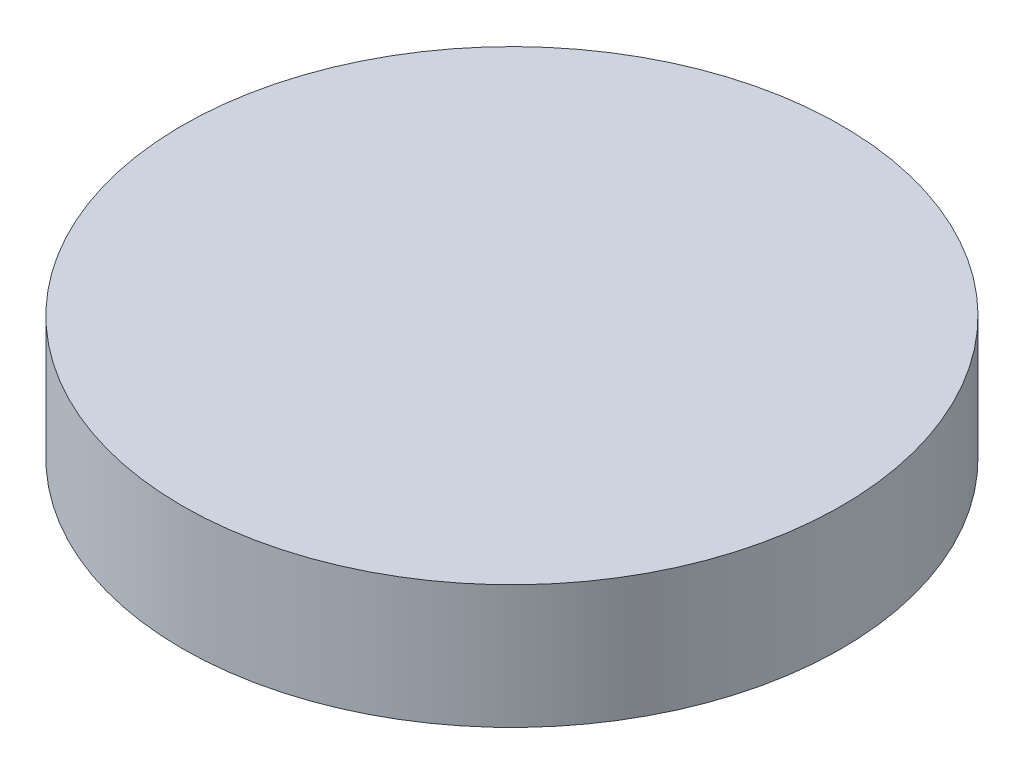
ISO-10303-21;
HEADER;
FILE_DESCRIPTION(('STEP AP214'),'2;1');
FILE_NAME('part.step','',(''),(''),'','','');
FILE_SCHEMA(('AUTOMOTIVE_DESIGN { 1 0 10303 214 1 1 1 1 }'));
ENDSEC;
DATA;
#1=APPLICATION_CONTEXT('core data for automotive mechanical design processes');
#2=APPLICATION_PROTOCOL_DEFINITION('international standard','automotive_design',2000,#1);
#3=PRODUCT_CONTEXT('',#1,'mechanical');
#4=PRODUCT('Part','Part','',(#3));
#5=PRODUCT_RELATED_PRODUCT_CATEGORY('part','',(#4));
#6=PRODUCT_DEFINITION_FORMATION('','',#4);
#7=PRODUCT_DEFINITION_CONTEXT('part definition',#1,'design');
#8=PRODUCT_DEFINITION('design','',#6,#7);
#9=PRODUCT_DEFINITION_SHAPE('','',#8);
#10=(LENGTH_UNIT() NAMED_UNIT(*) SI_UNIT(.MILLI.,.METRE.));
#11=(NAMED_UNIT(*) PLANE_ANGLE_UNIT() SI_UNIT($,.RADIAN.));
#12=(NAMED_UNIT(*) SI_UNIT($,.STERADIAN.) SOLID_ANGLE_UNIT());
#13=UNCERTAINTY_MEASURE_WITH_UNIT(LENGTH_MEASURE(1.E-05),#10,'distance_accuracy_value','');
#14=(GEOMETRIC_REPRESENTATION_CONTEXT(3) GLOBAL_UNCERTAINTY_ASSIGNED_CONTEXT((#13)) GLOBAL_UNIT_ASSIGNED_CONTEXT((#10,
#11,#12)) REPRESENTATION_CONTEXT('',''));
#15=CARTESIAN_POINT('',(0.,0.,0.));
#16=DIRECTION('',(0.,0.,1.));
#17=DIRECTION('',(1.,0.,0.));
#18=AXIS2_PLACEMENT_3D('',#15,#16,#17);
#19=CARTESIAN_POINT('',(0.,38.1,0.));
#20=DIRECTION('',(0.,-1.,0.));
#21=DIRECTION('',(0.,0.,-1.));
#22=AXIS2_PLACEMENT_3D('',#19,#20,#21);
#23=CYLINDRICAL_SURFACE('',#22,101.6);
#24=CARTESIAN_POINT('',(0.,38.1,0.));
#25=DIRECTION('',(0.,1.,0.));
#26=DIRECTION('',(0.,0.,1.));
#27=AXIS2_PLACEMENT_3D('',#24,#25,#26);
#28=CIRCLE('',#27,101.6);
#29=CARTESIAN_POINT('',(0.,38.1,101.6));
#30=VERTEX_POINT('',#29);
#31=EDGE_CURVE('E10',#30,#30,#28,.T.);
#32=ORIENTED_EDGE('',*,*,#31,.F.);
#33=EDGE_LOOP('',(#32));
#34=FACE_BOUND('',#33,.T.);
#35=CARTESIAN_POINT('',(0.,0.,0.));
#36=DIRECTION('',(0.,1.,0.));
#37=DIRECTION('',(0.,0.,1.));
#38=AXIS2_PLACEMENT_3D('',#35,#36,#37);
#39=CIRCLE('',#38,101.6);
#40=CARTESIAN_POINT('',(0.,0.,101.6));
#41=VERTEX_POINT('',#40);
#42=EDGE_CURVE('E36',#41,#41,#39,.T.);
#43=ORIENTED_EDGE('',*,*,#42,.T.);
#44=EDGE_LOOP('',(#43));
#45=FACE_BOUND('',#44,.T.);
#46=ADVANCED_FACE('F33',(#34,#45),#23,.T.);
#47=CARTESIAN_POINT('',(0.,38.1,0.));
#48=DIRECTION('',(0.,1.,0.));
#49=DIRECTION('',(0.,0.,1.));
#50=AXIS2_PLACEMENT_3D('',#47,#48,#49);
#51=PLANE('',#50);
#52=ORIENTED_EDGE('',*,*,#31,.T.);
#53=EDGE_LOOP('',(#52));
#54=FACE_BOUND('',#53,.T.);
#55=ADVANCED_FACE('F48',(#54),#51,.T.);
#56=CARTESIAN_POINT('',(0.,0.,0.));
#57=DIRECTION('',(0.,1.,0.));
#58=DIRECTION('',(0.,0.,1.));
#59=AXIS2_PLACEMENT_3D('',#56,#57,#58);
#60=PLANE('',#59);
#61=ORIENTED_EDGE('',*,*,#42,.F.);
#62=EDGE_LOOP('',(#61));
#63=FACE_BOUND('',#62,.T.);
#64=ADVANCED_FACE('F46',(#63),#60,.F.);
#65=CLOSED_SHELL('',(#46,#55,#64));
#66=MANIFOLD_SOLID_BREP('B2',#65);
#67=ADVANCED_BREP_SHAPE_REPRESENTATION('',(#18,#66),#14);
#68=SHAPE_DEFINITION_REPRESENTATION(#9,#67);
ENDSEC;
END-ISO-10303-21;
